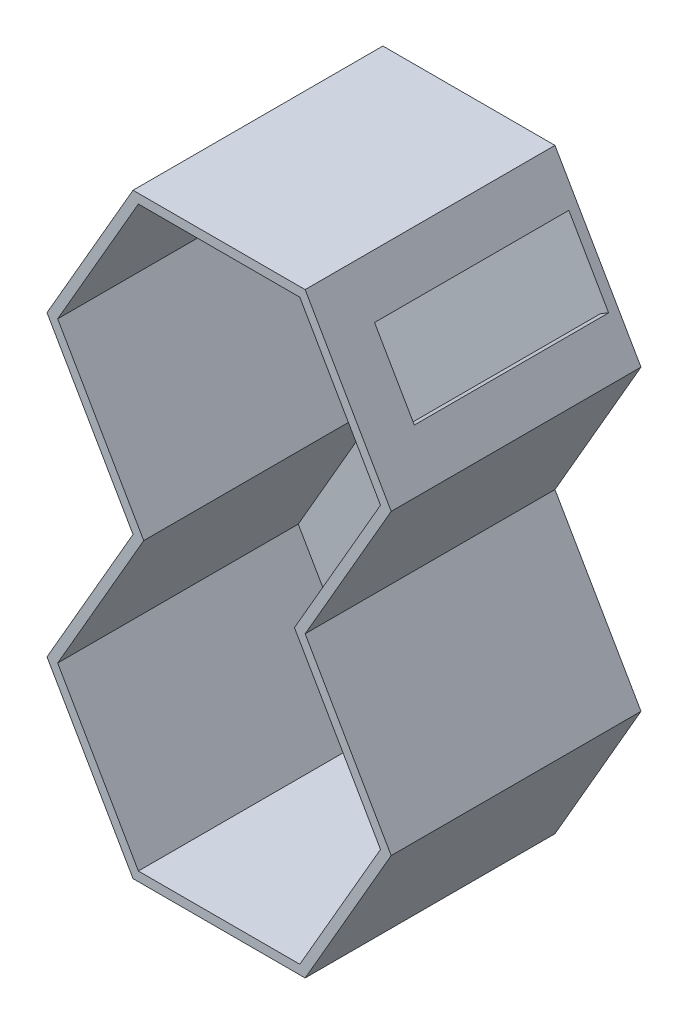
ISO-10303-21;
HEADER;
FILE_DESCRIPTION(('STEP AP214'),'2;1');
FILE_NAME('part.step','',(''),(''),'','','');
FILE_SCHEMA(('AUTOMOTIVE_DESIGN { 1 0 10303 214 1 1 1 1 }'));
ENDSEC;
DATA;
#1=APPLICATION_CONTEXT('core data for automotive mechanical design processes');
#2=APPLICATION_PROTOCOL_DEFINITION('international standard','automotive_design',2000,#1);
#3=PRODUCT_CONTEXT('',#1,'mechanical');
#4=PRODUCT('Part','Part','',(#3));
#5=PRODUCT_RELATED_PRODUCT_CATEGORY('part','',(#4));
#6=PRODUCT_DEFINITION_FORMATION('','',#4);
#7=PRODUCT_DEFINITION_CONTEXT('part definition',#1,'design');
#8=PRODUCT_DEFINITION('design','',#6,#7);
#9=PRODUCT_DEFINITION_SHAPE('','',#8);
#10=(LENGTH_UNIT() NAMED_UNIT(*) SI_UNIT(.MILLI.,.METRE.));
#11=(NAMED_UNIT(*) PLANE_ANGLE_UNIT() SI_UNIT($,.RADIAN.));
#12=(NAMED_UNIT(*) SI_UNIT($,.STERADIAN.) SOLID_ANGLE_UNIT());
#13=UNCERTAINTY_MEASURE_WITH_UNIT(LENGTH_MEASURE(1.E-05),#10,'distance_accuracy_value','');
#14=(GEOMETRIC_REPRESENTATION_CONTEXT(3) GLOBAL_UNCERTAINTY_ASSIGNED_CONTEXT((#13)) GLOBAL_UNIT_ASSIGNED_CONTEXT((#10,
#11,#12)) REPRESENTATION_CONTEXT('',''));
#15=CARTESIAN_POINT('',(0.,0.,0.));
#16=DIRECTION('',(0.,0.,1.));
#17=DIRECTION('',(1.,0.,0.));
#18=AXIS2_PLACEMENT_3D('',#15,#16,#17);
#19=CARTESIAN_POINT('',(-1744.52994616207,1610.80725103905,0.));
#20=DIRECTION('',(-0.866025403784439,-0.5,0.));
#21=DIRECTION('',(0.5,-0.866025403784439,0.));
#22=AXIS2_PLACEMENT_3D('',#19,#20,#21);
#23=PLANE('',#22);
#24=DIRECTION('',(0.,0.,1.));
#25=VECTOR('',#24,1.);
#26=CARTESIAN_POINT('',(-872.264973081038,99.9999999999995,1400.));
#27=LINE('',#26,#25);
#28=CARTESIAN_POINT('',(-872.264973081038,100.,100.));
#29=VERTEX_POINT('',#28);
#30=CARTESIAN_POINT('',(-872.264973081038,100.,2700.));
#31=VERTEX_POINT('',#30);
#32=EDGE_CURVE('E9',#29,#31,#27,.T.);
#33=ORIENTED_EDGE('',*,*,#32,.F.);
#34=DIRECTION('',(0.5,-0.866025403784439,0.));
#35=VECTOR('',#34,1.);
#36=CARTESIAN_POINT('',(-1308.39745962156,855.403625519526,100.));
#37=LINE('',#36,#35);
#38=CARTESIAN_POINT('',(-1744.52994616207,1610.80725103905,100.));
#39=VERTEX_POINT('',#38);
#40=EDGE_CURVE('E26',#39,#29,#37,.T.);
#41=ORIENTED_EDGE('',*,*,#40,.F.);
#42=DIRECTION('',(0.,0.,1.));
#43=VECTOR('',#42,1.);
#44=CARTESIAN_POINT('',(-1744.52994616207,1610.80725103905,1400.));
#45=LINE('',#44,#43);
#46=CARTESIAN_POINT('',(-1744.52994616207,1610.80725103905,2700.));
#47=VERTEX_POINT('',#46);
#48=EDGE_CURVE('E430',#39,#47,#45,.T.);
#49=ORIENTED_EDGE('',*,*,#48,.T.);
#50=DIRECTION('',(0.5,-0.866025403784439,0.));
#51=VECTOR('',#50,1.);
#52=CARTESIAN_POINT('',(-1308.39745962156,855.403625519526,2700.));
#53=LINE('',#52,#51);
#54=EDGE_CURVE('E35',#47,#31,#53,.T.);
#55=ORIENTED_EDGE('',*,*,#54,.T.);
#56=EDGE_LOOP('',(#33,#41,#49,#55));
#57=FACE_BOUND('',#56,.T.);
#58=ADVANCED_FACE('F15',(#57),#23,.F.);
#59=CARTESIAN_POINT('',(-814.529946162072,3221.61450207811,0.));
#60=DIRECTION('',(-0.866025403784439,0.5,0.));
#61=DIRECTION('',(-0.5,-0.866025403784439,0.));
#62=AXIS2_PLACEMENT_3D('',#59,#60,#61);
#63=PLANE('',#62);
#64=ORIENTED_EDGE('',*,*,#48,.F.);
#65=DIRECTION('',(-0.5,-0.866025403784439,0.));
#66=VECTOR('',#65,1.);
#67=CARTESIAN_POINT('',(-1279.52994616207,2416.21087655858,100.));
#68=LINE('',#67,#66);
#69=CARTESIAN_POINT('',(-814.529946162072,3221.61450207811,100.));
#70=VERTEX_POINT('',#69);
#71=EDGE_CURVE('E426',#70,#39,#68,.T.);
#72=ORIENTED_EDGE('',*,*,#71,.F.);
#73=DIRECTION('',(0.,0.,1.));
#74=VECTOR('',#73,1.);
#75=CARTESIAN_POINT('',(-814.529946162072,3221.61450207811,1400.));
#76=LINE('',#75,#74);
#77=CARTESIAN_POINT('',(-814.529946162073,3221.61450207811,2700.));
#78=VERTEX_POINT('',#77);
#79=EDGE_CURVE('E418',#70,#78,#76,.T.);
#80=ORIENTED_EDGE('',*,*,#79,.T.);
#81=DIRECTION('',(-0.5,-0.866025403784439,0.));
#82=VECTOR('',#81,1.);
#83=CARTESIAN_POINT('',(-1279.52994616207,2416.21087655858,2700.));
#84=LINE('',#83,#82);
#85=EDGE_CURVE('E425',#78,#47,#84,.T.);
#86=ORIENTED_EDGE('',*,*,#85,.T.);
#87=EDGE_LOOP('',(#64,#72,#80,#86));
#88=FACE_BOUND('',#87,.T.);
#89=ADVANCED_FACE('F448',(#88),#63,.F.);
#90=CARTESIAN_POINT('',(-1744.52994616207,4832.42175311717,0.));
#91=DIRECTION('',(-0.866025403784438,-0.500000000000001,0.));
#92=DIRECTION('',(0.500000000000001,-0.866025403784438,0.));
#93=AXIS2_PLACEMENT_3D('',#90,#91,#92);
#94=PLANE('',#93);
#95=ORIENTED_EDGE('',*,*,#79,.F.);
#96=DIRECTION('',(0.500000000000001,-0.866025403784438,0.));
#97=VECTOR('',#96,1.);
#98=CARTESIAN_POINT('',(-1279.52994616207,4027.01812759764,100.));
#99=LINE('',#98,#97);
#100=CARTESIAN_POINT('',(-1744.52994616207,4832.42175311717,100.));
#101=VERTEX_POINT('',#100);
#102=EDGE_CURVE('E414',#101,#70,#99,.T.);
#103=ORIENTED_EDGE('',*,*,#102,.F.);
#104=DIRECTION('',(0.,0.,1.));
#105=VECTOR('',#104,1.);
#106=CARTESIAN_POINT('',(-1744.52994616207,4832.42175311717,1400.));
#107=LINE('',#106,#105);
#108=CARTESIAN_POINT('',(-1744.52994616207,4832.42175311717,2700.));
#109=VERTEX_POINT('',#108);
#110=EDGE_CURVE('E406',#101,#109,#107,.T.);
#111=ORIENTED_EDGE('',*,*,#110,.T.);
#112=DIRECTION('',(0.500000000000001,-0.866025403784438,0.));
#113=VECTOR('',#112,1.);
#114=CARTESIAN_POINT('',(-1279.52994616207,4027.01812759764,2700.));
#115=LINE('',#114,#113);
#116=EDGE_CURVE('E413',#109,#78,#115,.T.);
#117=ORIENTED_EDGE('',*,*,#116,.T.);
#118=EDGE_LOOP('',(#95,#103,#111,#117));
#119=FACE_BOUND('',#118,.T.);
#120=ADVANCED_FACE('F460',(#119),#94,.F.);
#121=CARTESIAN_POINT('',(-872.264973081035,6343.22900415623,0.));
#122=DIRECTION('',(-0.866025403784439,0.499999999999999,0.));
#123=DIRECTION('',(-0.499999999999999,-0.866025403784439,0.));
#124=AXIS2_PLACEMENT_3D('',#121,#122,#123);
#125=PLANE('',#124);
#126=ORIENTED_EDGE('',*,*,#110,.F.);
#127=DIRECTION('',(-0.499999999999999,-0.866025403784439,0.));
#128=VECTOR('',#127,1.);
#129=CARTESIAN_POINT('',(-1308.39745962155,5587.8253786367,100.));
#130=LINE('',#129,#128);
#131=CARTESIAN_POINT('',(-872.264973081036,6343.22900415622,100.));
#132=VERTEX_POINT('',#131);
#133=EDGE_CURVE('E402',#132,#101,#130,.T.);
#134=ORIENTED_EDGE('',*,*,#133,.F.);
#135=DIRECTION('',(0.,0.,1.));
#136=VECTOR('',#135,1.);
#137=CARTESIAN_POINT('',(-872.264973081035,6343.22900415623,1400.));
#138=LINE('',#137,#136);
#139=CARTESIAN_POINT('',(-872.264973081036,6343.22900415622,2700.));
#140=VERTEX_POINT('',#139);
#141=EDGE_CURVE('E395',#132,#140,#138,.T.);
#142=ORIENTED_EDGE('',*,*,#141,.T.);
#143=DIRECTION('',(-0.499999999999999,-0.866025403784439,0.));
#144=VECTOR('',#143,1.);
#145=CARTESIAN_POINT('',(-1308.39745962155,5587.8253786367,2700.));
#146=LINE('',#145,#144);
#147=EDGE_CURVE('E401',#140,#109,#146,.T.);
#148=ORIENTED_EDGE('',*,*,#147,.T.);
#149=EDGE_LOOP('',(#126,#134,#142,#148));
#150=FACE_BOUND('',#149,.T.);
#151=ADVANCED_FACE('F462',(#150),#125,.F.);
#152=CARTESIAN_POINT('',(872.264973081037,6343.22900415622,0.));
#153=DIRECTION('',(0.,1.,0.));
#154=DIRECTION('',(0.,0.,1.));
#155=AXIS2_PLACEMENT_3D('',#152,#153,#154);
#156=PLANE('',#155);
#157=ORIENTED_EDGE('',*,*,#141,.F.);
#158=DIRECTION('',(-1.,0.,0.));
#159=VECTOR('',#158,1.);
#160=CARTESIAN_POINT('',(6.82121026329696E-13,6343.22900415622,100.));
#161=LINE('',#160,#159);
#162=CARTESIAN_POINT('',(872.264973081035,6343.22900415623,100.));
#163=VERTEX_POINT('',#162);
#164=EDGE_CURVE('E391',#163,#132,#161,.T.);
#165=ORIENTED_EDGE('',*,*,#164,.F.);
#166=DIRECTION('',(0.,0.,1.));
#167=VECTOR('',#166,1.);
#168=CARTESIAN_POINT('',(872.264973081037,6343.22900415622,1400.));
#169=LINE('',#168,#167);
#170=CARTESIAN_POINT('',(872.264973081035,6343.22900415623,2700.));
#171=VERTEX_POINT('',#170);
#172=EDGE_CURVE('E215',#163,#171,#169,.T.);
#173=ORIENTED_EDGE('',*,*,#172,.T.);
#174=DIRECTION('',(-1.,0.,0.));
#175=VECTOR('',#174,1.);
#176=CARTESIAN_POINT('',(5.6843418860808E-13,6343.22900415622,2700.));
#177=LINE('',#176,#175);
#178=EDGE_CURVE('E237',#171,#140,#177,.T.);
#179=ORIENTED_EDGE('',*,*,#178,.T.);
#180=EDGE_LOOP('',(#157,#165,#173,#179));
#181=FACE_BOUND('',#180,.T.);
#182=ADVANCED_FACE('F483',(#181),#156,.F.);
#183=CARTESIAN_POINT('',(814.529946162076,3221.61450207811,0.));
#184=DIRECTION('',(0.866025403784439,-0.499999999999999,0.));
#185=DIRECTION('',(0.499999999999999,0.866025403784439,0.));
#186=AXIS2_PLACEMENT_3D('',#183,#184,#185);
#187=PLANE('',#186);
#188=DIRECTION('',(0.,0.,1.));
#189=VECTOR('',#188,1.);
#190=CARTESIAN_POINT('',(1744.52994616207,4832.42175311717,1400.));
#191=LINE('',#190,#189);
#192=CARTESIAN_POINT('',(1744.52994616207,4832.42175311717,100.));
#193=VERTEX_POINT('',#192);
#194=CARTESIAN_POINT('',(1744.52994616207,4832.42175311717,2700.));
#195=VERTEX_POINT('',#194);
#196=EDGE_CURVE('E382',#193,#195,#191,.T.);
#197=ORIENTED_EDGE('',*,*,#196,.F.);
#198=DIRECTION('',(0.499999999999999,0.866025403784439,0.));
#199=VECTOR('',#198,1.);
#200=CARTESIAN_POINT('',(1279.52994616208,4027.01812759764,100.));
#201=LINE('',#200,#199);
#202=CARTESIAN_POINT('',(814.529946162075,3221.61450207811,100.));
#203=VERTEX_POINT('',#202);
#204=EDGE_CURVE('E379',#203,#193,#201,.T.);
#205=ORIENTED_EDGE('',*,*,#204,.F.);
#206=DIRECTION('',(0.,0.,1.));
#207=VECTOR('',#206,1.);
#208=CARTESIAN_POINT('',(814.529946162076,3221.61450207811,1400.));
#209=LINE('',#208,#207);
#210=CARTESIAN_POINT('',(814.529946162075,3221.61450207811,2700.));
#211=VERTEX_POINT('',#210);
#212=EDGE_CURVE('E372',#203,#211,#209,.T.);
#213=ORIENTED_EDGE('',*,*,#212,.T.);
#214=DIRECTION('',(0.499999999999999,0.866025403784439,0.));
#215=VECTOR('',#214,1.);
#216=CARTESIAN_POINT('',(1279.52994616208,4027.01812759764,2700.));
#217=LINE('',#216,#215);
#218=EDGE_CURVE('E236',#211,#195,#217,.T.);
#219=ORIENTED_EDGE('',*,*,#218,.T.);
#220=EDGE_LOOP('',(#197,#205,#213,#219));
#221=FACE_BOUND('',#220,.T.);
#222=ADVANCED_FACE('F471',(#221),#187,.F.);
#223=CARTESIAN_POINT('',(1744.52994616208,1610.80725103905,0.));
#224=DIRECTION('',(0.866025403784439,0.5,0.));
#225=DIRECTION('',(-0.5,0.866025403784439,0.));
#226=AXIS2_PLACEMENT_3D('',#223,#224,#225);
#227=PLANE('',#226);
#228=ORIENTED_EDGE('',*,*,#212,.F.);
#229=DIRECTION('',(-0.5,0.866025403784439,0.));
#230=VECTOR('',#229,1.);
#231=CARTESIAN_POINT('',(1279.52994616208,2416.21087655858,100.));
#232=LINE('',#231,#230);
#233=CARTESIAN_POINT('',(1744.52994616207,1610.80725103906,100.));
#234=VERTEX_POINT('',#233);
#235=EDGE_CURVE('E368',#234,#203,#232,.T.);
#236=ORIENTED_EDGE('',*,*,#235,.F.);
#237=DIRECTION('',(0.,0.,1.));
#238=VECTOR('',#237,1.);
#239=CARTESIAN_POINT('',(1744.52994616208,1610.80725103905,1400.));
#240=LINE('',#239,#238);
#241=CARTESIAN_POINT('',(1744.52994616207,1610.80725103906,2700.));
#242=VERTEX_POINT('',#241);
#243=EDGE_CURVE('E360',#234,#242,#240,.T.);
#244=ORIENTED_EDGE('',*,*,#243,.T.);
#245=DIRECTION('',(-0.5,0.866025403784439,0.));
#246=VECTOR('',#245,1.);
#247=CARTESIAN_POINT('',(1279.52994616208,2416.21087655858,2700.));
#248=LINE('',#247,#246);
#249=EDGE_CURVE('E367',#242,#211,#248,.T.);
#250=ORIENTED_EDGE('',*,*,#249,.T.);
#251=EDGE_LOOP('',(#228,#236,#244,#250));
#252=FACE_BOUND('',#251,.T.);
#253=ADVANCED_FACE('F474',(#252),#227,.F.);
#254=CARTESIAN_POINT('',(872.264973081037,100.,0.));
#255=DIRECTION('',(0.866025403784439,-0.499999999999999,0.));
#256=DIRECTION('',(0.499999999999999,0.866025403784439,0.));
#257=AXIS2_PLACEMENT_3D('',#254,#255,#256);
#258=PLANE('',#257);
#259=ORIENTED_EDGE('',*,*,#243,.F.);
#260=DIRECTION('',(0.499999999999999,0.866025403784439,0.));
#261=VECTOR('',#260,1.);
#262=CARTESIAN_POINT('',(1308.39745962156,855.403625519529,100.));
#263=LINE('',#262,#261);
#264=CARTESIAN_POINT('',(872.264973081038,100.,100.));
#265=VERTEX_POINT('',#264);
#266=EDGE_CURVE('E356',#265,#234,#263,.T.);
#267=ORIENTED_EDGE('',*,*,#266,.F.);
#268=DIRECTION('',(0.,0.,1.));
#269=VECTOR('',#268,1.);
#270=CARTESIAN_POINT('',(872.264973081037,100.,1400.));
#271=LINE('',#270,#269);
#272=CARTESIAN_POINT('',(872.264973081038,100.,2700.));
#273=VERTEX_POINT('',#272);
#274=EDGE_CURVE('E351',#265,#273,#271,.T.);
#275=ORIENTED_EDGE('',*,*,#274,.T.);
#276=DIRECTION('',(0.499999999999999,0.866025403784439,0.));
#277=VECTOR('',#276,1.);
#278=CARTESIAN_POINT('',(1308.39745962156,855.403625519529,2700.));
#279=LINE('',#278,#277);
#280=EDGE_CURVE('E355',#273,#242,#279,.T.);
#281=ORIENTED_EDGE('',*,*,#280,.T.);
#282=EDGE_LOOP('',(#259,#267,#275,#281));
#283=FACE_BOUND('',#282,.T.);
#284=ADVANCED_FACE('F476',(#283),#258,.F.);
#285=CARTESIAN_POINT('',(-872.264973081038,100.,0.));
#286=DIRECTION('',(0.,-1.,0.));
#287=DIRECTION('',(0.,0.,-1.));
#288=AXIS2_PLACEMENT_3D('',#285,#286,#287);
#289=PLANE('',#288);
#290=ORIENTED_EDGE('',*,*,#274,.F.);
#291=DIRECTION('',(1.,0.,0.));
#292=VECTOR('',#291,1.);
#293=CARTESIAN_POINT('',(1.13686837721616E-13,100.,100.));
#294=LINE('',#293,#292);
#295=EDGE_CURVE('E347',#29,#265,#294,.T.);
#296=ORIENTED_EDGE('',*,*,#295,.F.);
#297=ORIENTED_EDGE('',*,*,#32,.T.);
#298=DIRECTION('',(1.,0.,0.));
#299=VECTOR('',#298,1.);
#300=CARTESIAN_POINT('',(1.13686837721616E-13,100.,2700.));
#301=LINE('',#300,#299);
#302=EDGE_CURVE('E304',#31,#273,#301,.T.);
#303=ORIENTED_EDGE('',*,*,#302,.T.);
#304=EDGE_LOOP('',(#290,#296,#297,#303));
#305=FACE_BOUND('',#304,.T.);
#306=ADVANCED_FACE('F453',(#305),#289,.F.);
#307=CARTESIAN_POINT('',(0.,0.,0.));
#308=DIRECTION('',(0.,0.,1.));
#309=DIRECTION('',(1.,0.,0.));
#310=AXIS2_PLACEMENT_3D('',#307,#308,#309);
#311=PLANE('',#310);
#312=DIRECTION('',(0.5,0.866025403784439,0.));
#313=VECTOR('',#312,1.);
#314=CARTESIAN_POINT('',(1395.,805.403625519528,0.));
#315=LINE('',#314,#313);
#316=CARTESIAN_POINT('',(930.,0.,0.));
#317=VERTEX_POINT('',#316);
#318=CARTESIAN_POINT('',(1860.,1610.80725103906,0.));
#319=VERTEX_POINT('',#318);
#320=EDGE_CURVE('E343',#317,#319,#315,.T.);
#321=ORIENTED_EDGE('',*,*,#320,.F.);
#322=DIRECTION('',(1.,0.,0.));
#323=VECTOR('',#322,1.);
#324=CARTESIAN_POINT('',(0.,0.,0.));
#325=LINE('',#324,#323);
#326=CARTESIAN_POINT('',(-930.,0.,0.));
#327=VERTEX_POINT('',#326);
#328=EDGE_CURVE('E308',#327,#317,#325,.T.);
#329=ORIENTED_EDGE('',*,*,#328,.F.);
#330=DIRECTION('',(0.5,-0.866025403784439,0.));
#331=VECTOR('',#330,1.);
#332=CARTESIAN_POINT('',(-1395.,805.403625519527,0.));
#333=LINE('',#332,#331);
#334=CARTESIAN_POINT('',(-1860.,1610.80725103906,0.));
#335=VERTEX_POINT('',#334);
#336=EDGE_CURVE('E311',#335,#327,#333,.T.);
#337=ORIENTED_EDGE('',*,*,#336,.F.);
#338=DIRECTION('',(-0.5,-0.866025403784439,0.));
#339=VECTOR('',#338,1.);
#340=CARTESIAN_POINT('',(-1395.,2416.21087655858,0.));
#341=LINE('',#340,#339);
#342=CARTESIAN_POINT('',(-929.999999999997,3221.61450207811,0.));
#343=VERTEX_POINT('',#342);
#344=EDGE_CURVE('E315',#343,#335,#341,.T.);
#345=ORIENTED_EDGE('',*,*,#344,.F.);
#346=DIRECTION('',(0.500000000000001,-0.866025403784438,0.));
#347=VECTOR('',#346,1.);
#348=CARTESIAN_POINT('',(-1395.,4027.01812759764,0.));
#349=LINE('',#348,#347);
#350=CARTESIAN_POINT('',(-1860.,4832.42175311717,0.));
#351=VERTEX_POINT('',#350);
#352=EDGE_CURVE('E319',#351,#343,#349,.T.);
#353=ORIENTED_EDGE('',*,*,#352,.F.);
#354=DIRECTION('',(-0.499999999999999,-0.866025403784439,0.));
#355=VECTOR('',#354,1.);
#356=CARTESIAN_POINT('',(-1395.,5637.8253786367,0.));
#357=LINE('',#356,#355);
#358=CARTESIAN_POINT('',(-930.,6443.22900415623,0.));
#359=VERTEX_POINT('',#358);
#360=EDGE_CURVE('E323',#359,#351,#357,.T.);
#361=ORIENTED_EDGE('',*,*,#360,.F.);
#362=DIRECTION('',(-1.,0.,0.));
#363=VECTOR('',#362,1.);
#364=CARTESIAN_POINT('',(-5.6843418860808E-13,6443.22900415622,0.));
#365=LINE('',#364,#363);
#366=CARTESIAN_POINT('',(929.999999999998,6443.22900415622,0.));
#367=VERTEX_POINT('',#366);
#368=EDGE_CURVE('E327',#367,#359,#365,.T.);
#369=ORIENTED_EDGE('',*,*,#368,.F.);
#370=DIRECTION('',(-0.5,0.866025403784439,0.));
#371=VECTOR('',#370,1.);
#372=CARTESIAN_POINT('',(1395.,5637.82537863669,0.));
#373=LINE('',#372,#371);
#374=CARTESIAN_POINT('',(1860.,4832.42175311716,0.));
#375=VERTEX_POINT('',#374);
#376=EDGE_CURVE('E331',#375,#367,#373,.T.);
#377=ORIENTED_EDGE('',*,*,#376,.F.);
#378=DIRECTION('',(0.5,0.866025403784439,0.));
#379=VECTOR('',#378,1.);
#380=CARTESIAN_POINT('',(1395.,4027.01812759764,0.));
#381=LINE('',#380,#379);
#382=CARTESIAN_POINT('',(930.,3221.61450207811,0.));
#383=VERTEX_POINT('',#382);
#384=EDGE_CURVE('E335',#383,#375,#381,.T.);
#385=ORIENTED_EDGE('',*,*,#384,.F.);
#386=DIRECTION('',(-0.5,0.866025403784439,0.));
#387=VECTOR('',#386,1.);
#388=CARTESIAN_POINT('',(1395.,2416.21087655858,0.));
#389=LINE('',#388,#387);
#390=EDGE_CURVE('E339',#319,#383,#389,.T.);
#391=ORIENTED_EDGE('',*,*,#390,.F.);
#392=EDGE_LOOP('',(#321,#329,#337,#345,#353,#361,#369,#377,#385,#391));
#393=FACE_BOUND('',#392,.T.);
#394=ADVANCED_FACE('F546',(#393),#311,.F.);
#395=CARTESIAN_POINT('',(-930.,0.,0.));
#396=DIRECTION('',(0.,-1.,0.));
#397=DIRECTION('',(0.,0.,-1.));
#398=AXIS2_PLACEMENT_3D('',#395,#396,#397);
#399=PLANE('',#398);
#400=DIRECTION('',(1.,0.,0.));
#401=VECTOR('',#400,1.);
#402=CARTESIAN_POINT('',(0.,0.,2700.));
#403=LINE('',#402,#401);
#404=CARTESIAN_POINT('',(-930.,0.,2700.));
#405=VERTEX_POINT('',#404);
#406=CARTESIAN_POINT('',(930.,0.,2700.));
#407=VERTEX_POINT('',#406);
#408=EDGE_CURVE('E301',#405,#407,#403,.T.);
#409=ORIENTED_EDGE('',*,*,#408,.F.);
#410=DIRECTION('',(0.,0.,1.));
#411=VECTOR('',#410,1.);
#412=CARTESIAN_POINT('',(-930.,0.,1350.));
#413=LINE('',#412,#411);
#414=EDGE_CURVE('E298',#327,#405,#413,.T.);
#415=ORIENTED_EDGE('',*,*,#414,.F.);
#416=ORIENTED_EDGE('',*,*,#328,.T.);
#417=DIRECTION('',(0.,0.,1.));
#418=VECTOR('',#417,1.);
#419=CARTESIAN_POINT('',(930.,0.,1350.));
#420=LINE('',#419,#418);
#421=EDGE_CURVE('E247',#317,#407,#420,.T.);
#422=ORIENTED_EDGE('',*,*,#421,.T.);
#423=EDGE_LOOP('',(#409,#415,#416,#422));
#424=FACE_BOUND('',#423,.T.);
#425=ADVANCED_FACE('F554',(#424),#399,.T.);
#426=CARTESIAN_POINT('',(-1860.,1610.80725103906,0.));
#427=DIRECTION('',(-0.866025403784439,-0.5,0.));
#428=DIRECTION('',(0.5,-0.866025403784439,0.));
#429=AXIS2_PLACEMENT_3D('',#426,#427,#428);
#430=PLANE('',#429);
#431=DIRECTION('',(0.5,-0.866025403784439,0.));
#432=VECTOR('',#431,1.);
#433=CARTESIAN_POINT('',(-1395.,805.403625519527,2700.));
#434=LINE('',#433,#432);
#435=CARTESIAN_POINT('',(-1860.,1610.80725103906,2700.));
#436=VERTEX_POINT('',#435);
#437=EDGE_CURVE('E294',#436,#405,#434,.T.);
#438=ORIENTED_EDGE('',*,*,#437,.F.);
#439=DIRECTION('',(0.,0.,1.));
#440=VECTOR('',#439,1.);
#441=CARTESIAN_POINT('',(-1860.,1610.80725103906,1350.));
#442=LINE('',#441,#440);
#443=EDGE_CURVE('E291',#335,#436,#442,.T.);
#444=ORIENTED_EDGE('',*,*,#443,.F.);
#445=ORIENTED_EDGE('',*,*,#336,.T.);
#446=ORIENTED_EDGE('',*,*,#414,.T.);
#447=EDGE_LOOP('',(#438,#444,#445,#446));
#448=FACE_BOUND('',#447,.T.);
#449=ADVANCED_FACE('F563',(#448),#430,.T.);
#450=CARTESIAN_POINT('',(-929.999999999997,3221.61450207811,0.));
#451=DIRECTION('',(-0.866025403784439,0.5,0.));
#452=DIRECTION('',(-0.5,-0.866025403784439,0.));
#453=AXIS2_PLACEMENT_3D('',#450,#451,#452);
#454=PLANE('',#453);
#455=DIRECTION('',(-0.5,-0.866025403784439,0.));
#456=VECTOR('',#455,1.);
#457=CARTESIAN_POINT('',(-1395.,2416.21087655859,2700.));
#458=LINE('',#457,#456);
#459=CARTESIAN_POINT('',(-929.999999999998,3221.61450207811,2700.));
#460=VERTEX_POINT('',#459);
#461=EDGE_CURVE('E287',#460,#436,#458,.T.);
#462=ORIENTED_EDGE('',*,*,#461,.F.);
#463=DIRECTION('',(0.,0.,1.));
#464=VECTOR('',#463,1.);
#465=CARTESIAN_POINT('',(-929.999999999997,3221.61450207811,1350.));
#466=LINE('',#465,#464);
#467=EDGE_CURVE('E284',#343,#460,#466,.T.);
#468=ORIENTED_EDGE('',*,*,#467,.F.);
#469=ORIENTED_EDGE('',*,*,#344,.T.);
#470=ORIENTED_EDGE('',*,*,#443,.T.);
#471=EDGE_LOOP('',(#462,#468,#469,#470));
#472=FACE_BOUND('',#471,.T.);
#473=ADVANCED_FACE('F572',(#472),#454,.T.);
#474=CARTESIAN_POINT('',(-1860.,4832.42175311717,0.));
#475=DIRECTION('',(-0.866025403784438,-0.500000000000001,0.));
#476=DIRECTION('',(0.500000000000001,-0.866025403784438,0.));
#477=AXIS2_PLACEMENT_3D('',#474,#475,#476);
#478=PLANE('',#477);
#479=DIRECTION('',(0.500000000000001,-0.866025403784438,0.));
#480=VECTOR('',#479,1.);
#481=CARTESIAN_POINT('',(-1395.,4027.01812759764,2700.));
#482=LINE('',#481,#480);
#483=CARTESIAN_POINT('',(-1860.,4832.42175311717,2700.));
#484=VERTEX_POINT('',#483);
#485=EDGE_CURVE('E280',#484,#460,#482,.T.);
#486=ORIENTED_EDGE('',*,*,#485,.F.);
#487=DIRECTION('',(0.,0.,1.));
#488=VECTOR('',#487,1.);
#489=CARTESIAN_POINT('',(-1860.,4832.42175311717,1350.));
#490=LINE('',#489,#488);
#491=EDGE_CURVE('E277',#351,#484,#490,.T.);
#492=ORIENTED_EDGE('',*,*,#491,.F.);
#493=ORIENTED_EDGE('',*,*,#352,.T.);
#494=ORIENTED_EDGE('',*,*,#467,.T.);
#495=EDGE_LOOP('',(#486,#492,#493,#494));
#496=FACE_BOUND('',#495,.T.);
#497=ADVANCED_FACE('F581',(#496),#478,.T.);
#498=CARTESIAN_POINT('',(-930.,6443.22900415623,0.));
#499=DIRECTION('',(-0.866025403784439,0.499999999999999,0.));
#500=DIRECTION('',(-0.499999999999999,-0.866025403784439,0.));
#501=AXIS2_PLACEMENT_3D('',#498,#499,#500);
#502=PLANE('',#501);
#503=DIRECTION('',(-0.499999999999999,-0.866025403784439,0.));
#504=VECTOR('',#503,1.);
#505=CARTESIAN_POINT('',(-1395.,5637.8253786367,2700.));
#506=LINE('',#505,#504);
#507=CARTESIAN_POINT('',(-929.999999999999,6443.22900415622,2700.));
#508=VERTEX_POINT('',#507);
#509=EDGE_CURVE('E273',#508,#484,#506,.T.);
#510=ORIENTED_EDGE('',*,*,#509,.F.);
#511=DIRECTION('',(0.,0.,1.));
#512=VECTOR('',#511,1.);
#513=CARTESIAN_POINT('',(-930.,6443.22900415623,1350.));
#514=LINE('',#513,#512);
#515=EDGE_CURVE('E270',#359,#508,#514,.T.);
#516=ORIENTED_EDGE('',*,*,#515,.F.);
#517=ORIENTED_EDGE('',*,*,#360,.T.);
#518=ORIENTED_EDGE('',*,*,#491,.T.);
#519=EDGE_LOOP('',(#510,#516,#517,#518));
#520=FACE_BOUND('',#519,.T.);
#521=ADVANCED_FACE('F590',(#520),#502,.T.);
#522=CARTESIAN_POINT('',(929.999999999998,6443.22900415622,0.));
#523=DIRECTION('',(0.,1.,0.));
#524=DIRECTION('',(0.,0.,1.));
#525=AXIS2_PLACEMENT_3D('',#522,#523,#524);
#526=PLANE('',#525);
#527=DIRECTION('',(-1.,0.,0.));
#528=VECTOR('',#527,1.);
#529=CARTESIAN_POINT('',(-6.82121026329696E-13,6443.22900415622,2700.));
#530=LINE('',#529,#528);
#531=CARTESIAN_POINT('',(930.,6443.22900415622,2700.));
#532=VERTEX_POINT('',#531);
#533=EDGE_CURVE('E266',#532,#508,#530,.T.);
#534=ORIENTED_EDGE('',*,*,#533,.F.);
#535=DIRECTION('',(0.,0.,1.));
#536=VECTOR('',#535,1.);
#537=CARTESIAN_POINT('',(929.999999999998,6443.22900415622,1350.));
#538=LINE('',#537,#536);
#539=EDGE_CURVE('E263',#367,#532,#538,.T.);
#540=ORIENTED_EDGE('',*,*,#539,.F.);
#541=ORIENTED_EDGE('',*,*,#368,.T.);
#542=ORIENTED_EDGE('',*,*,#515,.T.);
#543=EDGE_LOOP('',(#534,#540,#541,#542));
#544=FACE_BOUND('',#543,.T.);
#545=ADVANCED_FACE('F599',(#544),#526,.T.);
#546=CARTESIAN_POINT('',(930.,3221.61450207811,0.));
#547=DIRECTION('',(0.866025403784439,-0.499999999999999,0.));
#548=DIRECTION('',(0.5,0.866025403784439,0.));
#549=AXIS2_PLACEMENT_3D('',#546,#547,#548);
#550=PLANE('',#549);
#551=DIRECTION('',(0.5,0.866025403784439,0.));
#552=VECTOR('',#551,1.);
#553=CARTESIAN_POINT('',(1395.,4027.01812759764,2700.));
#554=LINE('',#553,#552);
#555=CARTESIAN_POINT('',(930.,3221.61450207811,2700.));
#556=VERTEX_POINT('',#555);
#557=CARTESIAN_POINT('',(1860.,4832.42175311717,2700.));
#558=VERTEX_POINT('',#557);
#559=EDGE_CURVE('E257',#556,#558,#554,.T.);
#560=ORIENTED_EDGE('',*,*,#559,.F.);
#561=DIRECTION('',(0.,0.,1.));
#562=VECTOR('',#561,1.);
#563=CARTESIAN_POINT('',(930.,3221.61450207811,1350.));
#564=LINE('',#563,#562);
#565=EDGE_CURVE('E254',#383,#556,#564,.T.);
#566=ORIENTED_EDGE('',*,*,#565,.F.);
#567=ORIENTED_EDGE('',*,*,#384,.T.);
#568=DIRECTION('',(0.,0.,1.));
#569=VECTOR('',#568,1.);
#570=CARTESIAN_POINT('',(1860.,4832.42175311717,1350.));
#571=LINE('',#570,#569);
#572=EDGE_CURVE('E231',#375,#558,#571,.T.);
#573=ORIENTED_EDGE('',*,*,#572,.T.);
#574=EDGE_LOOP('',(#560,#566,#567,#573));
#575=FACE_BOUND('',#574,.T.);
#576=ADVANCED_FACE('F608',(#575),#550,.T.);
#577=CARTESIAN_POINT('',(1860.,1610.80725103906,0.));
#578=DIRECTION('',(0.866025403784439,0.5,0.));
#579=DIRECTION('',(-0.5,0.866025403784439,0.));
#580=AXIS2_PLACEMENT_3D('',#577,#578,#579);
#581=PLANE('',#580);
#582=DIRECTION('',(-0.5,0.866025403784439,0.));
#583=VECTOR('',#582,1.);
#584=CARTESIAN_POINT('',(1395.,2416.21087655858,2700.));
#585=LINE('',#584,#583);
#586=CARTESIAN_POINT('',(1860.,1610.80725103906,2700.));
#587=VERTEX_POINT('',#586);
#588=EDGE_CURVE('E250',#587,#556,#585,.T.);
#589=ORIENTED_EDGE('',*,*,#588,.F.);
#590=DIRECTION('',(0.,0.,1.));
#591=VECTOR('',#590,1.);
#592=CARTESIAN_POINT('',(1860.,1610.80725103906,1350.));
#593=LINE('',#592,#591);
#594=EDGE_CURVE('E246',#319,#587,#593,.T.);
#595=ORIENTED_EDGE('',*,*,#594,.F.);
#596=ORIENTED_EDGE('',*,*,#390,.T.);
#597=ORIENTED_EDGE('',*,*,#565,.T.);
#598=EDGE_LOOP('',(#589,#595,#596,#597));
#599=FACE_BOUND('',#598,.T.);
#600=ADVANCED_FACE('F617',(#599),#581,.T.);
#601=CARTESIAN_POINT('',(930.,-3.41060513164848E-13,0.));
#602=DIRECTION('',(0.866025403784439,-0.5,0.));
#603=DIRECTION('',(0.5,0.866025403784439,0.));
#604=AXIS2_PLACEMENT_3D('',#601,#602,#603);
#605=PLANE('',#604);
#606=DIRECTION('',(0.5,0.866025403784439,0.));
#607=VECTOR('',#606,1.);
#608=CARTESIAN_POINT('',(1395.,805.403625519528,2700.));
#609=LINE('',#608,#607);
#610=EDGE_CURVE('E242',#407,#587,#609,.T.);
#611=ORIENTED_EDGE('',*,*,#610,.F.);
#612=ORIENTED_EDGE('',*,*,#421,.F.);
#613=ORIENTED_EDGE('',*,*,#320,.T.);
#614=ORIENTED_EDGE('',*,*,#594,.T.);
#615=EDGE_LOOP('',(#611,#612,#613,#614));
#616=FACE_BOUND('',#615,.T.);
#617=ADVANCED_FACE('F626',(#616),#605,.T.);
#618=CARTESIAN_POINT('',(0.,0.,2700.));
#619=DIRECTION('',(0.,0.,1.));
#620=DIRECTION('',(1.,0.,0.));
#621=AXIS2_PLACEMENT_3D('',#618,#619,#620);
#622=PLANE('',#621);
#623=ORIENTED_EDGE('',*,*,#437,.T.);
#624=ORIENTED_EDGE('',*,*,#408,.T.);
#625=ORIENTED_EDGE('',*,*,#610,.T.);
#626=ORIENTED_EDGE('',*,*,#588,.T.);
#627=ORIENTED_EDGE('',*,*,#559,.T.);
#628=DIRECTION('',(-0.5,0.866025403784439,0.));
#629=VECTOR('',#628,1.);
#630=CARTESIAN_POINT('',(1395.,5637.82537863669,2700.));
#631=LINE('',#630,#629);
#632=EDGE_CURVE('E238',#558,#532,#631,.T.);
#633=ORIENTED_EDGE('',*,*,#632,.T.);
#634=ORIENTED_EDGE('',*,*,#533,.T.);
#635=ORIENTED_EDGE('',*,*,#509,.T.);
#636=ORIENTED_EDGE('',*,*,#485,.T.);
#637=ORIENTED_EDGE('',*,*,#461,.T.);
#638=EDGE_LOOP('',(#623,#624,#625,#626,#627,#633,#634,#635,#636,#637));
#639=FACE_BOUND('',#638,.T.);
#640=ORIENTED_EDGE('',*,*,#302,.F.);
#641=ORIENTED_EDGE('',*,*,#54,.F.);
#642=ORIENTED_EDGE('',*,*,#85,.F.);
#643=ORIENTED_EDGE('',*,*,#116,.F.);
#644=ORIENTED_EDGE('',*,*,#147,.F.);
#645=ORIENTED_EDGE('',*,*,#178,.F.);
#646=DIRECTION('',(-0.5,0.866025403784439,0.));
#647=VECTOR('',#646,1.);
#648=CARTESIAN_POINT('',(1308.39745962155,5587.8253786367,2700.));
#649=LINE('',#648,#647);
#650=EDGE_CURVE('E232',#195,#171,#649,.T.);
#651=ORIENTED_EDGE('',*,*,#650,.F.);
#652=ORIENTED_EDGE('',*,*,#218,.F.);
#653=ORIENTED_EDGE('',*,*,#249,.F.);
#654=ORIENTED_EDGE('',*,*,#280,.F.);
#655=EDGE_LOOP('',(#640,#641,#642,#643,#644,#645,#651,#652,#653,#654));
#656=FACE_BOUND('',#655,.T.);
#657=ADVANCED_FACE('F451',(#639,#656),#622,.T.);
#658=CARTESIAN_POINT('',(1860.,4832.42175311716,0.));
#659=DIRECTION('',(0.866025403784438,0.5,0.));
#660=DIRECTION('',(-0.5,0.866025403784439,0.));
#661=AXIS2_PLACEMENT_3D('',#658,#659,#660);
#662=PLANE('',#661);
#663=ORIENTED_EDGE('',*,*,#632,.F.);
#664=ORIENTED_EDGE('',*,*,#572,.F.);
#665=ORIENTED_EDGE('',*,*,#376,.T.);
#666=ORIENTED_EDGE('',*,*,#539,.T.);
#667=EDGE_LOOP('',(#663,#664,#665,#666));
#668=FACE_BOUND('',#667,.T.);
#669=DIRECTION('',(0.,0.,-1.));
#670=VECTOR('',#669,1.);
#671=CARTESIAN_POINT('',(1610.,5265.43445500938,1150.));
#672=LINE('',#671,#670);
#673=CARTESIAN_POINT('',(1610.,5265.43445500938,2200.));
#674=VERTEX_POINT('',#673);
#675=CARTESIAN_POINT('',(1610.,5265.43445500938,100.));
#676=VERTEX_POINT('',#675);
#677=EDGE_CURVE('E227',#674,#676,#672,.T.);
#678=ORIENTED_EDGE('',*,*,#677,.F.);
#679=DIRECTION('',(0.500000000000001,-0.866025403784438,0.));
#680=VECTOR('',#679,1.);
#681=CARTESIAN_POINT('',(1395.,5637.82537863669,2200.));
#682=LINE('',#681,#680);
#683=CARTESIAN_POINT('',(1180.,6010.216302264,2200.));
#684=VERTEX_POINT('',#683);
#685=EDGE_CURVE('E218',#684,#674,#682,.T.);
#686=ORIENTED_EDGE('',*,*,#685,.F.);
#687=DIRECTION('',(0.,0.,1.));
#688=VECTOR('',#687,1.);
#689=CARTESIAN_POINT('',(1180.,6010.216302264,1150.));
#690=LINE('',#689,#688);
#691=CARTESIAN_POINT('',(1180.,6010.216302264,100.));
#692=VERTEX_POINT('',#691);
#693=EDGE_CURVE('E197',#692,#684,#690,.T.);
#694=ORIENTED_EDGE('',*,*,#693,.F.);
#695=DIRECTION('',(-0.5,0.866025403784439,0.));
#696=VECTOR('',#695,1.);
#697=CARTESIAN_POINT('',(1395.,5637.82537863669,100.));
#698=LINE('',#697,#696);
#699=EDGE_CURVE('E223',#676,#692,#698,.T.);
#700=ORIENTED_EDGE('',*,*,#699,.F.);
#701=EDGE_LOOP('',(#678,#686,#694,#700));
#702=FACE_BOUND('',#701,.T.);
#703=ADVANCED_FACE('F482',(#668,#702),#662,.T.);
#704=CARTESIAN_POINT('',(1744.52994616207,4832.42175311717,0.));
#705=DIRECTION('',(0.866025403784438,0.5,0.));
#706=DIRECTION('',(-0.5,0.866025403784438,0.));
#707=AXIS2_PLACEMENT_3D('',#704,#705,#706);
#708=PLANE('',#707);
#709=DIRECTION('',(-0.500000000000001,0.866025403784438,0.));
#710=VECTOR('',#709,1.);
#711=CARTESIAN_POINT('',(982.831216351297,6151.72265321011,100.));
#712=LINE('',#711,#710);
#713=CARTESIAN_POINT('',(1093.39745962156,5960.216302264,100.));
#714=VERTEX_POINT('',#713);
#715=EDGE_CURVE('E189',#714,#163,#712,.T.);
#716=ORIENTED_EDGE('',*,*,#715,.F.);
#717=DIRECTION('',(0.,0.,1.));
#718=VECTOR('',#717,1.);
#719=CARTESIAN_POINT('',(1093.39745962156,5960.216302264,1150.));
#720=LINE('',#719,#718);
#721=CARTESIAN_POINT('',(1093.39745962156,5960.216302264,2200.));
#722=VERTEX_POINT('',#721);
#723=EDGE_CURVE('E186',#714,#722,#720,.T.);
#724=ORIENTED_EDGE('',*,*,#723,.T.);
#725=DIRECTION('',(0.5,-0.866025403784439,0.));
#726=VECTOR('',#725,1.);
#727=CARTESIAN_POINT('',(1308.39745962156,5587.82537863669,2200.));
#728=LINE('',#727,#726);
#729=CARTESIAN_POINT('',(1523.39745962156,5215.43445500938,2200.));
#730=VERTEX_POINT('',#729);
#731=EDGE_CURVE('E173',#722,#730,#728,.T.);
#732=ORIENTED_EDGE('',*,*,#731,.T.);
#733=DIRECTION('',(0.,0.,-1.));
#734=VECTOR('',#733,1.);
#735=CARTESIAN_POINT('',(1523.39745962156,5215.43445500938,1150.));
#736=LINE('',#735,#734);
#737=CARTESIAN_POINT('',(1523.39745962156,5215.43445500938,100.));
#738=VERTEX_POINT('',#737);
#739=EDGE_CURVE('E207',#730,#738,#736,.T.);
#740=ORIENTED_EDGE('',*,*,#739,.T.);
#741=DIRECTION('',(-0.5,0.866025403784439,0.));
#742=VECTOR('',#741,1.);
#743=CARTESIAN_POINT('',(1633.96370289182,5023.92810406327,100.));
#744=LINE('',#743,#742);
#745=EDGE_CURVE('E211',#193,#738,#744,.T.);
#746=ORIENTED_EDGE('',*,*,#745,.F.);
#747=ORIENTED_EDGE('',*,*,#196,.T.);
#748=ORIENTED_EDGE('',*,*,#650,.T.);
#749=ORIENTED_EDGE('',*,*,#172,.F.);
#750=EDGE_LOOP('',(#716,#724,#732,#740,#746,#747,#748,#749));
#751=FACE_BOUND('',#750,.T.);
#752=ADVANCED_FACE('F187',(#751),#708,.F.);
#753=CARTESIAN_POINT('',(1610.,5265.43445500938,2200.));
#754=DIRECTION('',(-0.5,0.866025403784438,0.));
#755=DIRECTION('',(-0.866025403784438,-0.5,0.));
#756=AXIS2_PLACEMENT_3D('',#753,#754,#755);
#757=PLANE('',#756);
#758=ORIENTED_EDGE('',*,*,#739,.F.);
#759=DIRECTION('',(-0.866025403784439,-0.5,0.));
#760=VECTOR('',#759,1.);
#761=CARTESIAN_POINT('',(1566.69872981078,5240.43445500938,2200.));
#762=LINE('',#761,#760);
#763=EDGE_CURVE('E182',#674,#730,#762,.T.);
#764=ORIENTED_EDGE('',*,*,#763,.F.);
#765=ORIENTED_EDGE('',*,*,#677,.T.);
#766=DIRECTION('',(-0.866025403784439,-0.5,0.));
#767=VECTOR('',#766,1.);
#768=CARTESIAN_POINT('',(1566.69872981078,5240.43445500938,99.9999999999991));
#769=LINE('',#768,#767);
#770=EDGE_CURVE('E199',#676,#738,#769,.T.);
#771=ORIENTED_EDGE('',*,*,#770,.T.);
#772=EDGE_LOOP('',(#758,#764,#765,#771));
#773=FACE_BOUND('',#772,.T.);
#774=ADVANCED_FACE('F479',(#773),#757,.T.);
#775=CARTESIAN_POINT('',(1180.,6010.216302264,99.9999999999994));
#776=DIRECTION('',(0.5,-0.866025403784438,0.));
#777=DIRECTION('',(0.866025403784438,0.5,0.));
#778=AXIS2_PLACEMENT_3D('',#775,#776,#777);
#779=PLANE('',#778);
#780=ORIENTED_EDGE('',*,*,#723,.F.);
#781=DIRECTION('',(-0.866025403784439,-0.5,0.));
#782=VECTOR('',#781,1.);
#783=CARTESIAN_POINT('',(1136.69872981078,5985.216302264,99.9999999999994));
#784=LINE('',#783,#782);
#785=EDGE_CURVE('E19',#692,#714,#784,.T.);
#786=ORIENTED_EDGE('',*,*,#785,.F.);
#787=ORIENTED_EDGE('',*,*,#693,.T.);
#788=DIRECTION('',(-0.866025403784439,-0.5,0.));
#789=VECTOR('',#788,1.);
#790=CARTESIAN_POINT('',(1136.69872981078,5985.216302264,2200.));
#791=LINE('',#790,#789);
#792=EDGE_CURVE('E180',#684,#722,#791,.T.);
#793=ORIENTED_EDGE('',*,*,#792,.T.);
#794=EDGE_LOOP('',(#780,#786,#787,#793));
#795=FACE_BOUND('',#794,.T.);
#796=ADVANCED_FACE('F196',(#795),#779,.T.);
#797=CARTESIAN_POINT('',(1180.,6010.216302264,2200.));
#798=DIRECTION('',(0.,0.,-1.));
#799=DIRECTION('',(-1.,0.,0.));
#800=AXIS2_PLACEMENT_3D('',#797,#798,#799);
#801=PLANE('',#800);
#802=ORIENTED_EDGE('',*,*,#731,.F.);
#803=ORIENTED_EDGE('',*,*,#792,.F.);
#804=ORIENTED_EDGE('',*,*,#685,.T.);
#805=ORIENTED_EDGE('',*,*,#763,.T.);
#806=EDGE_LOOP('',(#802,#803,#804,#805));
#807=FACE_BOUND('',#806,.T.);
#808=ADVANCED_FACE('F178',(#807),#801,.T.);
#809=CARTESIAN_POINT('',(0.,0.,100.));
#810=DIRECTION('',(0.,0.,1.));
#811=DIRECTION('',(1.,0.,0.));
#812=AXIS2_PLACEMENT_3D('',#809,#810,#811);
#813=PLANE('',#812);
#814=ORIENTED_EDGE('',*,*,#295,.T.);
#815=ORIENTED_EDGE('',*,*,#266,.T.);
#816=ORIENTED_EDGE('',*,*,#235,.T.);
#817=ORIENTED_EDGE('',*,*,#204,.T.);
#818=ORIENTED_EDGE('',*,*,#745,.T.);
#819=ORIENTED_EDGE('',*,*,#770,.F.);
#820=ORIENTED_EDGE('',*,*,#699,.T.);
#821=ORIENTED_EDGE('',*,*,#785,.T.);
#822=ORIENTED_EDGE('',*,*,#715,.T.);
#823=ORIENTED_EDGE('',*,*,#164,.T.);
#824=ORIENTED_EDGE('',*,*,#133,.T.);
#825=ORIENTED_EDGE('',*,*,#102,.T.);
#826=ORIENTED_EDGE('',*,*,#71,.T.);
#827=ORIENTED_EDGE('',*,*,#40,.T.);
#828=EDGE_LOOP('',(#814,#815,#816,#817,#818,#819,#820,#821,#822,#823,#824,#825,#826,#827));
#829=FACE_BOUND('',#828,.T.);
#830=ADVANCED_FACE('F17',(#829),#813,.T.);
#831=CLOSED_SHELL('',(#58,#89,#120,#151,#182,#222,#253,#284,#306,#394,#425,#449,#473,#497,#521,
#545,#576,#600,#617,#657,#703,#752,#774,#796,#808,#830));
#832=MANIFOLD_SOLID_BREP('B1',#831);
#833=ADVANCED_BREP_SHAPE_REPRESENTATION('',(#18,#832),#14);
#834=SHAPE_DEFINITION_REPRESENTATION(#9,#833);
ENDSEC;
END-ISO-10303-21;
